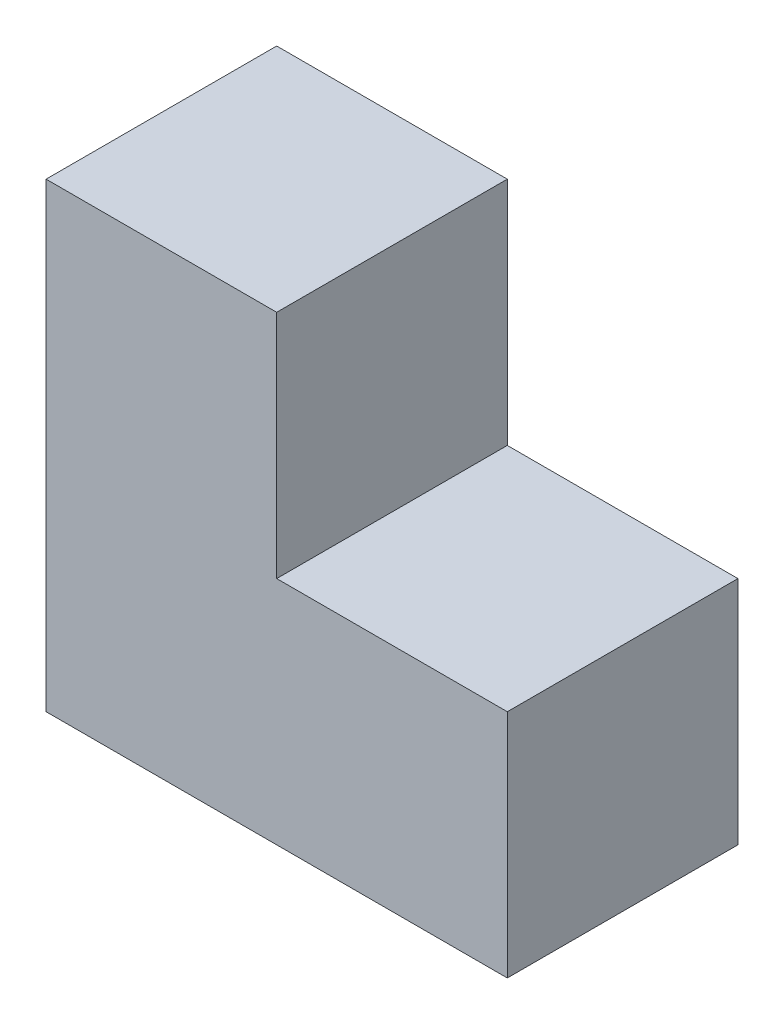
ISO-10303-21;
HEADER;
FILE_DESCRIPTION(('STEP AP214'),'2;1');
FILE_NAME('part.step','',(''),(''),'','','');
FILE_SCHEMA(('AUTOMOTIVE_DESIGN { 1 0 10303 214 1 1 1 1 }'));
ENDSEC;
DATA;
#1=APPLICATION_CONTEXT('core data for automotive mechanical design processes');
#2=APPLICATION_PROTOCOL_DEFINITION('international standard','automotive_design',2000,#1);
#3=PRODUCT_CONTEXT('',#1,'mechanical');
#4=PRODUCT('Part','Part','',(#3));
#5=PRODUCT_RELATED_PRODUCT_CATEGORY('part','',(#4));
#6=PRODUCT_DEFINITION_FORMATION('','',#4);
#7=PRODUCT_DEFINITION_CONTEXT('part definition',#1,'design');
#8=PRODUCT_DEFINITION('design','',#6,#7);
#9=PRODUCT_DEFINITION_SHAPE('','',#8);
#10=(LENGTH_UNIT() NAMED_UNIT(*) SI_UNIT(.MILLI.,.METRE.));
#11=(NAMED_UNIT(*) PLANE_ANGLE_UNIT() SI_UNIT($,.RADIAN.));
#12=(NAMED_UNIT(*) SI_UNIT($,.STERADIAN.) SOLID_ANGLE_UNIT());
#13=UNCERTAINTY_MEASURE_WITH_UNIT(LENGTH_MEASURE(1.E-05),#10,'distance_accuracy_value','');
#14=(GEOMETRIC_REPRESENTATION_CONTEXT(3) GLOBAL_UNCERTAINTY_ASSIGNED_CONTEXT((#13)) GLOBAL_UNIT_ASSIGNED_CONTEXT((#10,
#11,#12)) REPRESENTATION_CONTEXT('',''));
#15=CARTESIAN_POINT('',(0.,0.,0.));
#16=DIRECTION('',(0.,0.,1.));
#17=DIRECTION('',(1.,0.,0.));
#18=AXIS2_PLACEMENT_3D('',#15,#16,#17);
#19=CARTESIAN_POINT('',(-30.,0.,-30.));
#20=DIRECTION('',(0.,-1.,0.));
#21=DIRECTION('',(1.,0.,0.));
#22=AXIS2_PLACEMENT_3D('',#19,#20,#21);
#23=PLANE('',#22);
#24=DIRECTION('',(1.,0.,0.));
#25=VECTOR('',#24,1.);
#26=CARTESIAN_POINT('',(-30.,0.,0.));
#27=LINE('',#26,#25);
#28=CARTESIAN_POINT('',(-30.,0.,0.));
#29=VERTEX_POINT('',#28);
#30=CARTESIAN_POINT('',(30.,0.,0.));
#31=VERTEX_POINT('',#30);
#32=EDGE_CURVE('E118',#29,#31,#27,.T.);
#33=ORIENTED_EDGE('',*,*,#32,.F.);
#34=DIRECTION('',(0.,0.,1.));
#35=VECTOR('',#34,1.);
#36=CARTESIAN_POINT('',(-30.,0.,-30.));
#37=LINE('',#36,#35);
#38=CARTESIAN_POINT('',(-30.,0.,-30.));
#39=VERTEX_POINT('',#38);
#40=EDGE_CURVE('E11',#39,#29,#37,.T.);
#41=ORIENTED_EDGE('',*,*,#40,.F.);
#42=DIRECTION('',(1.,0.,0.));
#43=VECTOR('',#42,1.);
#44=CARTESIAN_POINT('',(-30.,0.,-30.));
#45=LINE('',#44,#43);
#46=CARTESIAN_POINT('',(30.,0.,-30.));
#47=VERTEX_POINT('',#46);
#48=EDGE_CURVE('E132',#39,#47,#45,.T.);
#49=ORIENTED_EDGE('',*,*,#48,.T.);
#50=DIRECTION('',(0.,0.,1.));
#51=VECTOR('',#50,1.);
#52=CARTESIAN_POINT('',(30.,0.,-30.));
#53=LINE('',#52,#51);
#54=EDGE_CURVE('E36',#47,#31,#53,.T.);
#55=ORIENTED_EDGE('',*,*,#54,.T.);
#56=EDGE_LOOP('',(#33,#41,#49,#55));
#57=FACE_BOUND('',#56,.T.);
#58=ADVANCED_FACE('F33',(#57),#23,.T.);
#59=CARTESIAN_POINT('',(-30.,60.,-30.));
#60=DIRECTION('',(-1.,0.,0.));
#61=DIRECTION('',(0.,-1.,0.));
#62=AXIS2_PLACEMENT_3D('',#59,#60,#61);
#63=PLANE('',#62);
#64=DIRECTION('',(0.,-1.,0.));
#65=VECTOR('',#64,1.);
#66=CARTESIAN_POINT('',(-30.,60.,0.));
#67=LINE('',#66,#65);
#68=CARTESIAN_POINT('',(-30.,60.,0.));
#69=VERTEX_POINT('',#68);
#70=EDGE_CURVE('E130',#69,#29,#67,.T.);
#71=ORIENTED_EDGE('',*,*,#70,.F.);
#72=DIRECTION('',(0.,0.,1.));
#73=VECTOR('',#72,1.);
#74=CARTESIAN_POINT('',(-30.,60.,-30.));
#75=LINE('',#74,#73);
#76=CARTESIAN_POINT('',(-30.,60.,-30.));
#77=VERTEX_POINT('',#76);
#78=EDGE_CURVE('E42',#77,#69,#75,.T.);
#79=ORIENTED_EDGE('',*,*,#78,.F.);
#80=DIRECTION('',(0.,-1.,0.));
#81=VECTOR('',#80,1.);
#82=CARTESIAN_POINT('',(-30.,60.,-30.));
#83=LINE('',#82,#81);
#84=EDGE_CURVE('E108',#77,#39,#83,.T.);
#85=ORIENTED_EDGE('',*,*,#84,.T.);
#86=ORIENTED_EDGE('',*,*,#40,.T.);
#87=EDGE_LOOP('',(#71,#79,#85,#86));
#88=FACE_BOUND('',#87,.T.);
#89=ADVANCED_FACE('F140',(#88),#63,.T.);
#90=CARTESIAN_POINT('',(0.,60.,-30.));
#91=DIRECTION('',(0.,1.,0.));
#92=DIRECTION('',(-1.,0.,0.));
#93=AXIS2_PLACEMENT_3D('',#90,#91,#92);
#94=PLANE('',#93);
#95=DIRECTION('',(-1.,0.,0.));
#96=VECTOR('',#95,1.);
#97=CARTESIAN_POINT('',(0.,60.,0.));
#98=LINE('',#97,#96);
#99=CARTESIAN_POINT('',(0.,60.,0.));
#100=VERTEX_POINT('',#99);
#101=EDGE_CURVE('E95',#100,#69,#98,.T.);
#102=ORIENTED_EDGE('',*,*,#101,.F.);
#103=DIRECTION('',(0.,0.,1.));
#104=VECTOR('',#103,1.);
#105=CARTESIAN_POINT('',(0.,60.,-30.));
#106=LINE('',#105,#104);
#107=CARTESIAN_POINT('',(0.,60.,-30.));
#108=VERTEX_POINT('',#107);
#109=EDGE_CURVE('E90',#108,#100,#106,.T.);
#110=ORIENTED_EDGE('',*,*,#109,.F.);
#111=DIRECTION('',(-1.,0.,0.));
#112=VECTOR('',#111,1.);
#113=CARTESIAN_POINT('',(0.,60.,-30.));
#114=LINE('',#113,#112);
#115=EDGE_CURVE('E93',#108,#77,#114,.T.);
#116=ORIENTED_EDGE('',*,*,#115,.T.);
#117=ORIENTED_EDGE('',*,*,#78,.T.);
#118=EDGE_LOOP('',(#102,#110,#116,#117));
#119=FACE_BOUND('',#118,.T.);
#120=ADVANCED_FACE('F92',(#119),#94,.T.);
#121=CARTESIAN_POINT('',(0.,30.,-30.));
#122=DIRECTION('',(1.,0.,0.));
#123=DIRECTION('',(0.,1.,0.));
#124=AXIS2_PLACEMENT_3D('',#121,#122,#123);
#125=PLANE('',#124);
#126=DIRECTION('',(0.,1.,0.));
#127=VECTOR('',#126,1.);
#128=CARTESIAN_POINT('',(0.,30.,0.));
#129=LINE('',#128,#127);
#130=CARTESIAN_POINT('',(0.,30.,0.));
#131=VERTEX_POINT('',#130);
#132=EDGE_CURVE('E127',#131,#100,#129,.T.);
#133=ORIENTED_EDGE('',*,*,#132,.F.);
#134=DIRECTION('',(0.,0.,1.));
#135=VECTOR('',#134,1.);
#136=CARTESIAN_POINT('',(0.,30.,-30.));
#137=LINE('',#136,#135);
#138=CARTESIAN_POINT('',(0.,30.,-30.));
#139=VERTEX_POINT('',#138);
#140=EDGE_CURVE('E100',#139,#131,#137,.T.);
#141=ORIENTED_EDGE('',*,*,#140,.F.);
#142=DIRECTION('',(0.,1.,0.));
#143=VECTOR('',#142,1.);
#144=CARTESIAN_POINT('',(0.,30.,-30.));
#145=LINE('',#144,#143);
#146=EDGE_CURVE('E106',#139,#108,#145,.T.);
#147=ORIENTED_EDGE('',*,*,#146,.T.);
#148=ORIENTED_EDGE('',*,*,#109,.T.);
#149=EDGE_LOOP('',(#133,#141,#147,#148));
#150=FACE_BOUND('',#149,.T.);
#151=ADVANCED_FACE('F110',(#150),#125,.T.);
#152=CARTESIAN_POINT('',(30.,30.,-30.));
#153=DIRECTION('',(0.,1.,0.));
#154=DIRECTION('',(-1.,0.,0.));
#155=AXIS2_PLACEMENT_3D('',#152,#153,#154);
#156=PLANE('',#155);
#157=DIRECTION('',(-1.,0.,0.));
#158=VECTOR('',#157,1.);
#159=CARTESIAN_POINT('',(30.,30.,0.));
#160=LINE('',#159,#158);
#161=CARTESIAN_POINT('',(30.,30.,0.));
#162=VERTEX_POINT('',#161);
#163=EDGE_CURVE('E124',#162,#131,#160,.T.);
#164=ORIENTED_EDGE('',*,*,#163,.F.);
#165=DIRECTION('',(0.,0.,1.));
#166=VECTOR('',#165,1.);
#167=CARTESIAN_POINT('',(30.,30.,-30.));
#168=LINE('',#167,#166);
#169=CARTESIAN_POINT('',(30.,30.,-30.));
#170=VERTEX_POINT('',#169);
#171=EDGE_CURVE('E135',#170,#162,#168,.T.);
#172=ORIENTED_EDGE('',*,*,#171,.F.);
#173=DIRECTION('',(-1.,0.,0.));
#174=VECTOR('',#173,1.);
#175=CARTESIAN_POINT('',(30.,30.,-30.));
#176=LINE('',#175,#174);
#177=EDGE_CURVE('E111',#170,#139,#176,.T.);
#178=ORIENTED_EDGE('',*,*,#177,.T.);
#179=ORIENTED_EDGE('',*,*,#140,.T.);
#180=EDGE_LOOP('',(#164,#172,#178,#179));
#181=FACE_BOUND('',#180,.T.);
#182=ADVANCED_FACE('F153',(#181),#156,.T.);
#183=CARTESIAN_POINT('',(30.,0.,-30.));
#184=DIRECTION('',(1.,0.,0.));
#185=DIRECTION('',(0.,1.,0.));
#186=AXIS2_PLACEMENT_3D('',#183,#184,#185);
#187=PLANE('',#186);
#188=DIRECTION('',(0.,1.,0.));
#189=VECTOR('',#188,1.);
#190=CARTESIAN_POINT('',(30.,0.,0.));
#191=LINE('',#190,#189);
#192=EDGE_CURVE('E121',#31,#162,#191,.T.);
#193=ORIENTED_EDGE('',*,*,#192,.F.);
#194=ORIENTED_EDGE('',*,*,#54,.F.);
#195=DIRECTION('',(0.,1.,0.));
#196=VECTOR('',#195,1.);
#197=CARTESIAN_POINT('',(30.,0.,-30.));
#198=LINE('',#197,#196);
#199=EDGE_CURVE('E113',#47,#170,#198,.T.);
#200=ORIENTED_EDGE('',*,*,#199,.T.);
#201=ORIENTED_EDGE('',*,*,#171,.T.);
#202=EDGE_LOOP('',(#193,#194,#200,#201));
#203=FACE_BOUND('',#202,.T.);
#204=ADVANCED_FACE('F137',(#203),#187,.T.);
#205=CARTESIAN_POINT('',(0.,0.,-30.));
#206=DIRECTION('',(0.,0.,1.));
#207=DIRECTION('',(1.,0.,0.));
#208=AXIS2_PLACEMENT_3D('',#205,#206,#207);
#209=PLANE('',#208);
#210=ORIENTED_EDGE('',*,*,#48,.F.);
#211=ORIENTED_EDGE('',*,*,#84,.F.);
#212=ORIENTED_EDGE('',*,*,#115,.F.);
#213=ORIENTED_EDGE('',*,*,#146,.F.);
#214=ORIENTED_EDGE('',*,*,#177,.F.);
#215=ORIENTED_EDGE('',*,*,#199,.F.);
#216=EDGE_LOOP('',(#210,#211,#212,#213,#214,#215));
#217=FACE_BOUND('',#216,.T.);
#218=ADVANCED_FACE('F104',(#217),#209,.F.);
#219=CARTESIAN_POINT('',(0.,0.,0.));
#220=DIRECTION('',(0.,0.,1.));
#221=DIRECTION('',(1.,0.,0.));
#222=AXIS2_PLACEMENT_3D('',#219,#220,#221);
#223=PLANE('',#222);
#224=ORIENTED_EDGE('',*,*,#32,.T.);
#225=ORIENTED_EDGE('',*,*,#192,.T.);
#226=ORIENTED_EDGE('',*,*,#163,.T.);
#227=ORIENTED_EDGE('',*,*,#132,.T.);
#228=ORIENTED_EDGE('',*,*,#101,.T.);
#229=ORIENTED_EDGE('',*,*,#70,.T.);
#230=EDGE_LOOP('',(#224,#225,#226,#227,#228,#229));
#231=FACE_BOUND('',#230,.T.);
#232=ADVANCED_FACE('F139',(#231),#223,.T.);
#233=CLOSED_SHELL('',(#58,#89,#120,#151,#182,#204,#218,#232));
#234=MANIFOLD_SOLID_BREP('B2',#233);
#235=ADVANCED_BREP_SHAPE_REPRESENTATION('',(#18,#234),#14);
#236=SHAPE_DEFINITION_REPRESENTATION(#9,#235);
ENDSEC;
END-ISO-10303-21;
